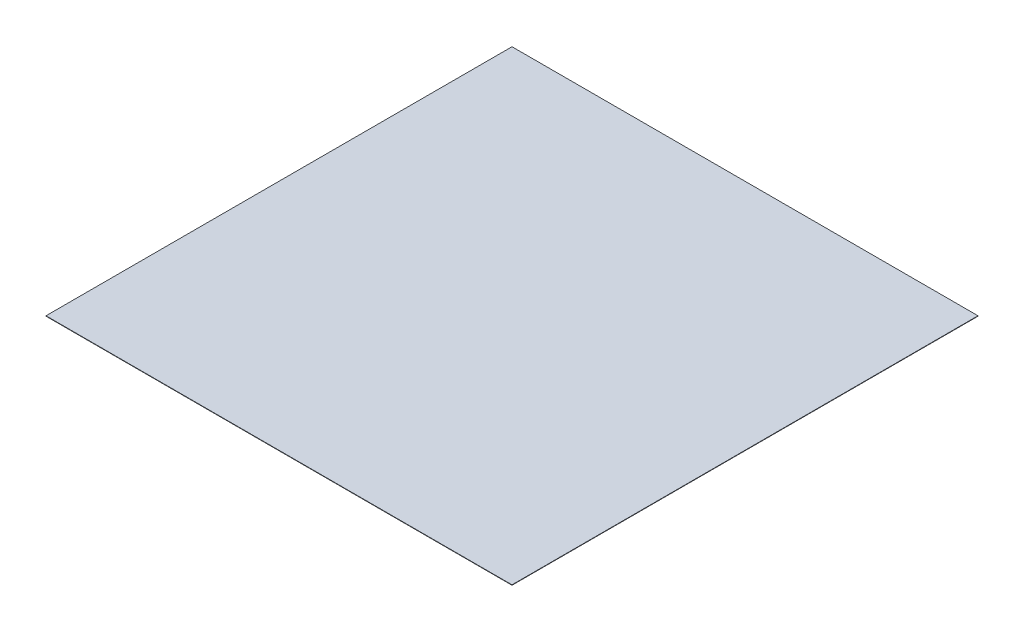
ISO-10303-21;
HEADER;
FILE_DESCRIPTION(('STEP AP214'),'2;1');
FILE_NAME('part.step','',(''),(''),'','','');
FILE_SCHEMA(('AUTOMOTIVE_DESIGN { 1 0 10303 214 1 1 1 1 }'));
ENDSEC;
DATA;
#1=APPLICATION_CONTEXT('core data for automotive mechanical design processes');
#2=APPLICATION_PROTOCOL_DEFINITION('international standard','automotive_design',2000,#1);
#3=PRODUCT_CONTEXT('',#1,'mechanical');
#4=PRODUCT('Part','Part','',(#3));
#5=PRODUCT_RELATED_PRODUCT_CATEGORY('part','',(#4));
#6=PRODUCT_DEFINITION_FORMATION('','',#4);
#7=PRODUCT_DEFINITION_CONTEXT('part definition',#1,'design');
#8=PRODUCT_DEFINITION('design','',#6,#7);
#9=PRODUCT_DEFINITION_SHAPE('','',#8);
#10=(LENGTH_UNIT() NAMED_UNIT(*) SI_UNIT(.MILLI.,.METRE.));
#11=(NAMED_UNIT(*) PLANE_ANGLE_UNIT() SI_UNIT($,.RADIAN.));
#12=(NAMED_UNIT(*) SI_UNIT($,.STERADIAN.) SOLID_ANGLE_UNIT());
#13=UNCERTAINTY_MEASURE_WITH_UNIT(LENGTH_MEASURE(1.E-05),#10,'distance_accuracy_value','');
#14=(GEOMETRIC_REPRESENTATION_CONTEXT(3) GLOBAL_UNCERTAINTY_ASSIGNED_CONTEXT((#13)) GLOBAL_UNIT_ASSIGNED_CONTEXT((#10,
#11,#12)) REPRESENTATION_CONTEXT('',''));
#15=CARTESIAN_POINT('',(0.,0.,0.));
#16=DIRECTION('',(0.,0.,1.));
#17=DIRECTION('',(1.,0.,0.));
#18=AXIS2_PLACEMENT_3D('',#15,#16,#17);
#19=CARTESIAN_POINT('',(-0.175,0.0003,-0.175));
#20=DIRECTION('',(1.,0.,0.));
#21=DIRECTION('',(0.,0.,-1.));
#22=AXIS2_PLACEMENT_3D('',#19,#20,#21);
#23=PLANE('',#22);
#24=DIRECTION('',(0.,0.,1.));
#25=VECTOR('',#24,1.);
#26=CARTESIAN_POINT('',(-0.175,0.,-0.175));
#27=LINE('',#26,#25);
#28=CARTESIAN_POINT('',(-0.175,0.,-0.175));
#29=VERTEX_POINT('',#28);
#30=CARTESIAN_POINT('',(-0.175,0.,0.175));
#31=VERTEX_POINT('',#30);
#32=EDGE_CURVE('E96',#29,#31,#27,.T.);
#33=ORIENTED_EDGE('',*,*,#32,.T.);
#34=DIRECTION('',(0.,-1.,0.));
#35=VECTOR('',#34,1.);
#36=CARTESIAN_POINT('',(-0.175,0.0003,0.175));
#37=LINE('',#36,#35);
#38=CARTESIAN_POINT('',(-0.175,0.0003,0.175));
#39=VERTEX_POINT('',#38);
#40=EDGE_CURVE('E11',#39,#31,#37,.T.);
#41=ORIENTED_EDGE('',*,*,#40,.F.);
#42=DIRECTION('',(0.,0.,1.));
#43=VECTOR('',#42,1.);
#44=CARTESIAN_POINT('',(-0.175,0.0003,-0.175));
#45=LINE('',#44,#43);
#46=CARTESIAN_POINT('',(-0.175,0.0003,-0.175));
#47=VERTEX_POINT('',#46);
#48=EDGE_CURVE('E84',#47,#39,#45,.T.);
#49=ORIENTED_EDGE('',*,*,#48,.F.);
#50=DIRECTION('',(0.,-1.,0.));
#51=VECTOR('',#50,1.);
#52=CARTESIAN_POINT('',(-0.175,0.0003,-0.175));
#53=LINE('',#52,#51);
#54=EDGE_CURVE('E92',#47,#29,#53,.T.);
#55=ORIENTED_EDGE('',*,*,#54,.T.);
#56=EDGE_LOOP('',(#33,#41,#49,#55));
#57=FACE_BOUND('',#56,.T.);
#58=ADVANCED_FACE('F33',(#57),#23,.F.);
#59=CARTESIAN_POINT('',(-0.175,0.0003,0.175));
#60=DIRECTION('',(0.,0.,-1.));
#61=DIRECTION('',(-1.,0.,0.));
#62=AXIS2_PLACEMENT_3D('',#59,#60,#61);
#63=PLANE('',#62);
#64=DIRECTION('',(1.,0.,0.));
#65=VECTOR('',#64,1.);
#66=CARTESIAN_POINT('',(-0.175,0.,0.175));
#67=LINE('',#66,#65);
#68=CARTESIAN_POINT('',(0.175,0.,0.175));
#69=VERTEX_POINT('',#68);
#70=EDGE_CURVE('E88',#31,#69,#67,.T.);
#71=ORIENTED_EDGE('',*,*,#70,.T.);
#72=DIRECTION('',(0.,-1.,0.));
#73=VECTOR('',#72,1.);
#74=CARTESIAN_POINT('',(0.175,0.0003,0.175));
#75=LINE('',#74,#73);
#76=CARTESIAN_POINT('',(0.175,0.0003,0.175));
#77=VERTEX_POINT('',#76);
#78=EDGE_CURVE('E41',#77,#69,#75,.T.);
#79=ORIENTED_EDGE('',*,*,#78,.F.);
#80=DIRECTION('',(1.,0.,0.));
#81=VECTOR('',#80,1.);
#82=CARTESIAN_POINT('',(-0.175,0.0003,0.175));
#83=LINE('',#82,#81);
#84=EDGE_CURVE('E79',#39,#77,#83,.T.);
#85=ORIENTED_EDGE('',*,*,#84,.F.);
#86=ORIENTED_EDGE('',*,*,#40,.T.);
#87=EDGE_LOOP('',(#71,#79,#85,#86));
#88=FACE_BOUND('',#87,.T.);
#89=ADVANCED_FACE('F87',(#88),#63,.F.);
#90=CARTESIAN_POINT('',(0.175,0.0003,-0.175));
#91=DIRECTION('',(-1.,0.,0.));
#92=DIRECTION('',(0.,0.,1.));
#93=AXIS2_PLACEMENT_3D('',#90,#91,#92);
#94=PLANE('',#93);
#95=DIRECTION('',(0.,0.,-1.));
#96=VECTOR('',#95,1.);
#97=CARTESIAN_POINT('',(0.175,0.,-0.175));
#98=LINE('',#97,#96);
#99=CARTESIAN_POINT('',(0.175,0.,-0.175));
#100=VERTEX_POINT('',#99);
#101=EDGE_CURVE('E66',#69,#100,#98,.T.);
#102=ORIENTED_EDGE('',*,*,#101,.T.);
#103=DIRECTION('',(0.,-1.,0.));
#104=VECTOR('',#103,1.);
#105=CARTESIAN_POINT('',(0.175,0.0003,-0.175));
#106=LINE('',#105,#104);
#107=CARTESIAN_POINT('',(0.175,0.0003,-0.175));
#108=VERTEX_POINT('',#107);
#109=EDGE_CURVE('E89',#108,#100,#106,.T.);
#110=ORIENTED_EDGE('',*,*,#109,.F.);
#111=DIRECTION('',(0.,0.,-1.));
#112=VECTOR('',#111,1.);
#113=CARTESIAN_POINT('',(0.175,0.0003,-0.175));
#114=LINE('',#113,#112);
#115=EDGE_CURVE('E82',#77,#108,#114,.T.);
#116=ORIENTED_EDGE('',*,*,#115,.F.);
#117=ORIENTED_EDGE('',*,*,#78,.T.);
#118=EDGE_LOOP('',(#102,#110,#116,#117));
#119=FACE_BOUND('',#118,.T.);
#120=ADVANCED_FACE('F90',(#119),#94,.F.);
#121=CARTESIAN_POINT('',(-0.175,0.0003,-0.175));
#122=DIRECTION('',(0.,0.,1.));
#123=DIRECTION('',(1.,0.,0.));
#124=AXIS2_PLACEMENT_3D('',#121,#122,#123);
#125=PLANE('',#124);
#126=DIRECTION('',(-1.,0.,0.));
#127=VECTOR('',#126,1.);
#128=CARTESIAN_POINT('',(-0.175,0.,-0.175));
#129=LINE('',#128,#127);
#130=EDGE_CURVE('E72',#100,#29,#129,.T.);
#131=ORIENTED_EDGE('',*,*,#130,.T.);
#132=ORIENTED_EDGE('',*,*,#54,.F.);
#133=DIRECTION('',(-1.,0.,0.));
#134=VECTOR('',#133,1.);
#135=CARTESIAN_POINT('',(-0.175,0.0003,-0.175));
#136=LINE('',#135,#134);
#137=EDGE_CURVE('E49',#108,#47,#136,.T.);
#138=ORIENTED_EDGE('',*,*,#137,.F.);
#139=ORIENTED_EDGE('',*,*,#109,.T.);
#140=EDGE_LOOP('',(#131,#132,#138,#139));
#141=FACE_BOUND('',#140,.T.);
#142=ADVANCED_FACE('F103',(#141),#125,.F.);
#143=CARTESIAN_POINT('',(0.,0.0003,0.));
#144=DIRECTION('',(0.,1.,0.));
#145=DIRECTION('',(0.,0.,1.));
#146=AXIS2_PLACEMENT_3D('',#143,#144,#145);
#147=PLANE('',#146);
#148=ORIENTED_EDGE('',*,*,#48,.T.);
#149=ORIENTED_EDGE('',*,*,#84,.T.);
#150=ORIENTED_EDGE('',*,*,#115,.T.);
#151=ORIENTED_EDGE('',*,*,#137,.T.);
#152=EDGE_LOOP('',(#148,#149,#150,#151));
#153=FACE_BOUND('',#152,.T.);
#154=ADVANCED_FACE('F80',(#153),#147,.T.);
#155=CARTESIAN_POINT('',(0.,0.,0.));
#156=DIRECTION('',(0.,1.,0.));
#157=DIRECTION('',(0.,0.,1.));
#158=AXIS2_PLACEMENT_3D('',#155,#156,#157);
#159=PLANE('',#158);
#160=ORIENTED_EDGE('',*,*,#32,.F.);
#161=ORIENTED_EDGE('',*,*,#130,.F.);
#162=ORIENTED_EDGE('',*,*,#101,.F.);
#163=ORIENTED_EDGE('',*,*,#70,.F.);
#164=EDGE_LOOP('',(#160,#161,#162,#163));
#165=FACE_BOUND('',#164,.T.);
#166=ADVANCED_FACE('F106',(#165),#159,.F.);
#167=CLOSED_SHELL('',(#58,#89,#120,#142,#154,#166));
#168=MANIFOLD_SOLID_BREP('B2',#167);
#169=ADVANCED_BREP_SHAPE_REPRESENTATION('',(#18,#168),#14);
#170=SHAPE_DEFINITION_REPRESENTATION(#9,#169);
ENDSEC;
END-ISO-10303-21;
